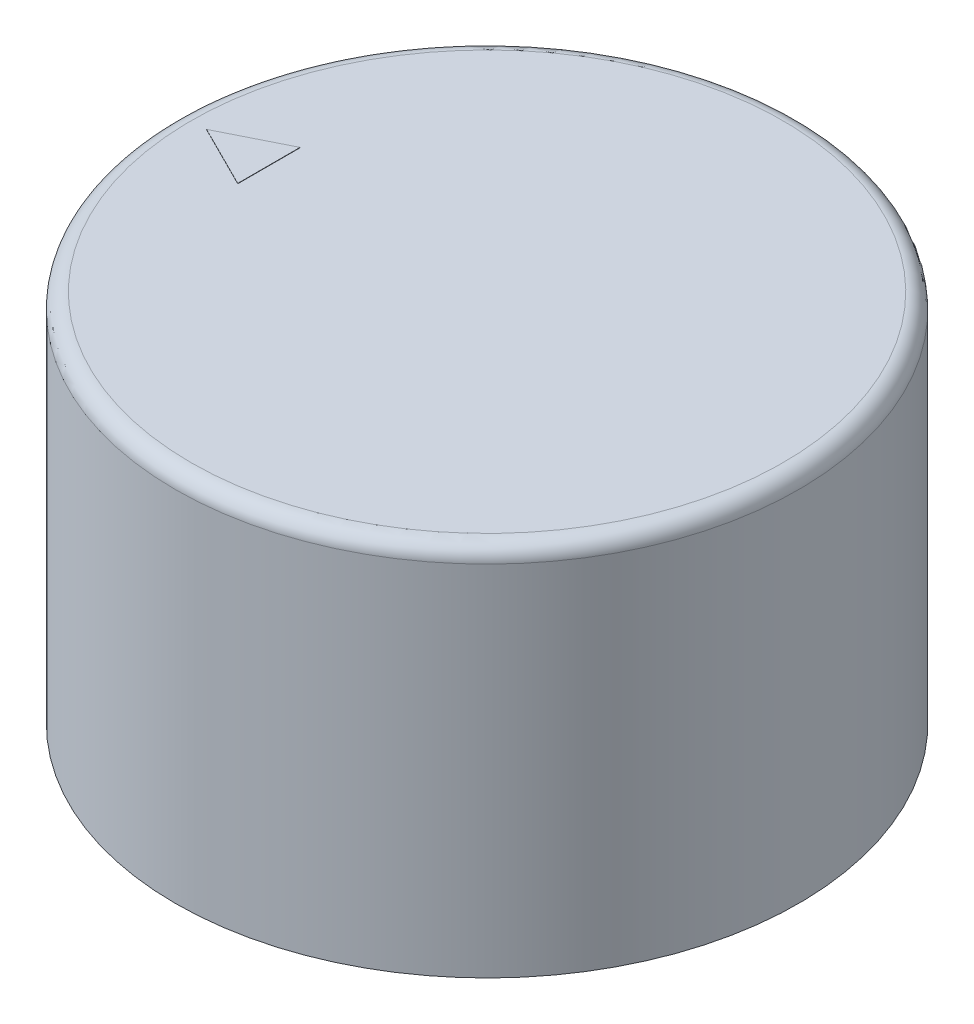
ISO-10303-21;
HEADER;
FILE_DESCRIPTION(('STEP AP214'),'2;1');
FILE_NAME('part.step','',(''),(''),'','','');
FILE_SCHEMA(('AUTOMOTIVE_DESIGN { 1 0 10303 214 1 1 1 1 }'));
ENDSEC;
DATA;
#1=APPLICATION_CONTEXT('core data for automotive mechanical design processes');
#2=APPLICATION_PROTOCOL_DEFINITION('international standard','automotive_design',2000,#1);
#3=PRODUCT_CONTEXT('',#1,'mechanical');
#4=PRODUCT('Part','Part','',(#3));
#5=PRODUCT_RELATED_PRODUCT_CATEGORY('part','',(#4));
#6=PRODUCT_DEFINITION_FORMATION('','',#4);
#7=PRODUCT_DEFINITION_CONTEXT('part definition',#1,'design');
#8=PRODUCT_DEFINITION('design','',#6,#7);
#9=PRODUCT_DEFINITION_SHAPE('','',#8);
#10=(LENGTH_UNIT() NAMED_UNIT(*) SI_UNIT(.MILLI.,.METRE.));
#11=(NAMED_UNIT(*) PLANE_ANGLE_UNIT() SI_UNIT($,.RADIAN.));
#12=(NAMED_UNIT(*) SI_UNIT($,.STERADIAN.) SOLID_ANGLE_UNIT());
#13=UNCERTAINTY_MEASURE_WITH_UNIT(LENGTH_MEASURE(1.E-05),#10,'distance_accuracy_value','');
#14=(GEOMETRIC_REPRESENTATION_CONTEXT(3) GLOBAL_UNCERTAINTY_ASSIGNED_CONTEXT((#13)) GLOBAL_UNIT_ASSIGNED_CONTEXT((#10,
#11,#12)) REPRESENTATION_CONTEXT('',''));
#15=CARTESIAN_POINT('',(0.,0.,0.));
#16=DIRECTION('',(0.,0.,1.));
#17=DIRECTION('',(1.,0.,0.));
#18=AXIS2_PLACEMENT_3D('',#15,#16,#17);
#19=CARTESIAN_POINT('',(0.,12.,0.));
#20=DIRECTION('',(0.,1.,0.));
#21=DIRECTION('',(0.,0.,1.));
#22=AXIS2_PLACEMENT_3D('',#19,#20,#21);
#23=PLANE('',#22);
#24=CARTESIAN_POINT('',(0.,12.,0.));
#25=DIRECTION('',(0.,1.,0.));
#26=DIRECTION('',(0.,0.,1.));
#27=AXIS2_PLACEMENT_3D('',#24,#25,#26);
#28=CIRCLE('',#27,9.5);
#29=CARTESIAN_POINT('',(0.,12.,9.5));
#30=VERTEX_POINT('',#29);
#31=EDGE_CURVE('E52',#30,#30,#28,.T.);
#32=ORIENTED_EDGE('',*,*,#31,.T.);
#33=EDGE_LOOP('',(#32));
#34=FACE_BOUND('',#33,.T.);
#35=DIRECTION('',(-0.894427190999916,0.,0.447213595499958));
#36=VECTOR('',#35,1.);
#37=CARTESIAN_POINT('',(-1.8,12.,-3.6));
#38=LINE('',#37,#36);
#39=CARTESIAN_POINT('',(-7.,12.,-0.999999999999999));
#40=VERTEX_POINT('',#39);
#41=CARTESIAN_POINT('',(-9.,12.,0.));
#42=VERTEX_POINT('',#41);
#43=EDGE_CURVE('E234',#40,#42,#38,.T.);
#44=ORIENTED_EDGE('',*,*,#43,.F.);
#45=DIRECTION('',(0.,0.,-1.));
#46=VECTOR('',#45,1.);
#47=CARTESIAN_POINT('',(-7.,12.,0.));
#48=LINE('',#47,#46);
#49=CARTESIAN_POINT('',(-7.,12.,1.));
#50=VERTEX_POINT('',#49);
#51=EDGE_CURVE('E94',#50,#40,#48,.T.);
#52=ORIENTED_EDGE('',*,*,#51,.F.);
#53=DIRECTION('',(0.894427190999916,0.,0.447213595499958));
#54=VECTOR('',#53,1.);
#55=CARTESIAN_POINT('',(-1.8,12.,3.6));
#56=LINE('',#55,#54);
#57=EDGE_CURVE('E77',#42,#50,#56,.T.);
#58=ORIENTED_EDGE('',*,*,#57,.F.);
#59=EDGE_LOOP('',(#44,#52,#58));
#60=FACE_BOUND('',#59,.T.);
#61=ADVANCED_FACE('F44',(#34,#60),#23,.T.);
#62=CARTESIAN_POINT('',(0.,12.,0.));
#63=DIRECTION('',(0.,-1.,0.));
#64=DIRECTION('',(0.,0.,-1.));
#65=AXIS2_PLACEMENT_3D('',#62,#63,#64);
#66=CYLINDRICAL_SURFACE('',#65,10.);
#67=CARTESIAN_POINT('',(0.,11.5,0.));
#68=DIRECTION('',(0.,1.,0.));
#69=DIRECTION('',(0.,0.,1.));
#70=AXIS2_PLACEMENT_3D('',#67,#68,#69);
#71=CIRCLE('',#70,10.);
#72=CARTESIAN_POINT('',(0.,11.5,10.));
#73=VERTEX_POINT('',#72);
#74=EDGE_CURVE('E12',#73,#73,#71,.F.);
#75=ORIENTED_EDGE('',*,*,#74,.T.);
#76=EDGE_LOOP('',(#75));
#77=FACE_BOUND('',#76,.T.);
#78=CARTESIAN_POINT('',(0.,0.,0.));
#79=DIRECTION('',(0.,1.,0.));
#80=DIRECTION('',(0.,0.,1.));
#81=AXIS2_PLACEMENT_3D('',#78,#79,#80);
#82=CIRCLE('',#81,10.);
#83=CARTESIAN_POINT('',(0.,0.,10.));
#84=VERTEX_POINT('',#83);
#85=EDGE_CURVE('E107',#84,#84,#82,.T.);
#86=ORIENTED_EDGE('',*,*,#85,.T.);
#87=EDGE_LOOP('',(#86));
#88=FACE_BOUND('',#87,.T.);
#89=ADVANCED_FACE('F125',(#77,#88),#66,.T.);
#90=CARTESIAN_POINT('',(0.,0.,0.));
#91=DIRECTION('',(0.,1.,0.));
#92=DIRECTION('',(0.,0.,1.));
#93=AXIS2_PLACEMENT_3D('',#90,#91,#92);
#94=PLANE('',#93);
#95=CARTESIAN_POINT('',(0.,0.,0.));
#96=DIRECTION('',(0.,-1.,0.));
#97=DIRECTION('',(0.,0.,-1.));
#98=AXIS2_PLACEMENT_3D('',#95,#96,#97);
#99=CIRCLE('',#98,3.);
#100=CARTESIAN_POINT('',(0.,0.,-3.));
#101=VERTEX_POINT('',#100);
#102=EDGE_CURVE('E96',#101,#101,#99,.T.);
#103=ORIENTED_EDGE('',*,*,#102,.F.);
#104=EDGE_LOOP('',(#103));
#105=FACE_BOUND('',#104,.T.);
#106=ORIENTED_EDGE('',*,*,#85,.F.);
#107=EDGE_LOOP('',(#106));
#108=FACE_BOUND('',#107,.T.);
#109=ADVANCED_FACE('F116',(#105,#108),#94,.F.);
#110=CARTESIAN_POINT('',(0.,11.5,0.));
#111=DIRECTION('',(0.,1.,0.));
#112=DIRECTION('',(0.,0.,1.));
#113=AXIS2_PLACEMENT_3D('',#110,#111,#112);
#114=TOROIDAL_SURFACE('',#113,9.5,0.5);
#115=ORIENTED_EDGE('',*,*,#74,.F.);
#116=EDGE_LOOP('',(#115));
#117=FACE_BOUND('',#116,.T.);
#118=ORIENTED_EDGE('',*,*,#31,.F.);
#119=EDGE_LOOP('',(#118));
#120=FACE_BOUND('',#119,.T.);
#121=ADVANCED_FACE('F46',(#117,#120),#114,.T.);
#122=CARTESIAN_POINT('',(0.,10.,0.));
#123=DIRECTION('',(0.,1.,0.));
#124=DIRECTION('',(0.,0.,1.));
#125=AXIS2_PLACEMENT_3D('',#122,#123,#124);
#126=PLANE('',#125);
#127=CARTESIAN_POINT('',(0.,10.,0.));
#128=DIRECTION('',(0.,1.,0.));
#129=DIRECTION('',(0.,0.,1.));
#130=AXIS2_PLACEMENT_3D('',#127,#128,#129);
#131=CIRCLE('',#130,3.);
#132=CARTESIAN_POINT('',(0.,10.,3.));
#133=VERTEX_POINT('',#132);
#134=EDGE_CURVE('E99',#133,#133,#131,.F.);
#135=ORIENTED_EDGE('',*,*,#134,.T.);
#136=EDGE_LOOP('',(#135));
#137=FACE_BOUND('',#136,.T.);
#138=ADVANCED_FACE('F115',(#137),#126,.F.);
#139=CARTESIAN_POINT('',(0.,20.4852813742386,0.));
#140=DIRECTION('',(0.,-1.,0.));
#141=DIRECTION('',(0.,0.,-1.));
#142=AXIS2_PLACEMENT_3D('',#139,#140,#141);
#143=CYLINDRICAL_SURFACE('',#142,3.);
#144=ORIENTED_EDGE('',*,*,#102,.T.);
#145=EDGE_LOOP('',(#144));
#146=FACE_BOUND('',#145,.T.);
#147=ORIENTED_EDGE('',*,*,#134,.F.);
#148=EDGE_LOOP('',(#147));
#149=FACE_BOUND('',#148,.T.);
#150=ADVANCED_FACE('F122',(#146,#149),#143,.F.);
#151=CARTESIAN_POINT('',(-7.,12.01,0.));
#152=DIRECTION('',(-1.,0.,0.));
#153=DIRECTION('',(0.,0.,1.));
#154=AXIS2_PLACEMENT_3D('',#151,#152,#153);
#155=PLANE('',#154);
#156=ORIENTED_EDGE('',*,*,#51,.T.);
#157=DIRECTION('',(0.,-1.,0.));
#158=VECTOR('',#157,1.);
#159=CARTESIAN_POINT('',(-7.,12.01,-0.999999999999999));
#160=LINE('',#159,#158);
#161=CARTESIAN_POINT('',(-7.,12.01,-0.999999999999999));
#162=VERTEX_POINT('',#161);
#163=EDGE_CURVE('E84',#162,#40,#160,.T.);
#164=ORIENTED_EDGE('',*,*,#163,.F.);
#165=DIRECTION('',(0.,0.,-1.));
#166=VECTOR('',#165,1.);
#167=CARTESIAN_POINT('',(-7.,12.01,0.));
#168=LINE('',#167,#166);
#169=CARTESIAN_POINT('',(-7.,12.01,1.));
#170=VERTEX_POINT('',#169);
#171=EDGE_CURVE('E86',#170,#162,#168,.T.);
#172=ORIENTED_EDGE('',*,*,#171,.F.);
#173=DIRECTION('',(0.,-1.,0.));
#174=VECTOR('',#173,1.);
#175=CARTESIAN_POINT('',(-7.,12.01,1.));
#176=LINE('',#175,#174);
#177=EDGE_CURVE('E101',#170,#50,#176,.T.);
#178=ORIENTED_EDGE('',*,*,#177,.T.);
#179=EDGE_LOOP('',(#156,#164,#172,#178));
#180=FACE_BOUND('',#179,.T.);
#181=ADVANCED_FACE('F92',(#180),#155,.F.);
#182=CARTESIAN_POINT('',(-1.8,12.01,-3.6));
#183=DIRECTION('',(0.447213595499958,0.,0.894427190999916));
#184=DIRECTION('',(0.894427190999916,0.,-0.447213595499958));
#185=AXIS2_PLACEMENT_3D('',#182,#183,#184);
#186=PLANE('',#185);
#187=ORIENTED_EDGE('',*,*,#43,.T.);
#188=DIRECTION('',(0.,-1.,0.));
#189=VECTOR('',#188,1.);
#190=CARTESIAN_POINT('',(-9.,12.01,0.));
#191=LINE('',#190,#189);
#192=CARTESIAN_POINT('',(-9.,12.01,0.));
#193=VERTEX_POINT('',#192);
#194=EDGE_CURVE('E59',#193,#42,#191,.T.);
#195=ORIENTED_EDGE('',*,*,#194,.F.);
#196=DIRECTION('',(-0.894427190999916,0.,0.447213595499958));
#197=VECTOR('',#196,1.);
#198=CARTESIAN_POINT('',(-1.8,12.01,-3.6));
#199=LINE('',#198,#197);
#200=EDGE_CURVE('E81',#162,#193,#199,.T.);
#201=ORIENTED_EDGE('',*,*,#200,.F.);
#202=ORIENTED_EDGE('',*,*,#163,.T.);
#203=EDGE_LOOP('',(#187,#195,#201,#202));
#204=FACE_BOUND('',#203,.T.);
#205=ADVANCED_FACE('F82',(#204),#186,.F.);
#206=CARTESIAN_POINT('',(-1.8,12.01,3.6));
#207=DIRECTION('',(0.447213595499958,0.,-0.894427190999916));
#208=DIRECTION('',(-0.894427190999916,0.,-0.447213595499958));
#209=AXIS2_PLACEMENT_3D('',#206,#207,#208);
#210=PLANE('',#209);
#211=ORIENTED_EDGE('',*,*,#57,.T.);
#212=ORIENTED_EDGE('',*,*,#177,.F.);
#213=DIRECTION('',(0.894427190999916,0.,0.447213595499958));
#214=VECTOR('',#213,1.);
#215=CARTESIAN_POINT('',(-1.8,12.01,3.6));
#216=LINE('',#215,#214);
#217=EDGE_CURVE('E67',#193,#170,#216,.T.);
#218=ORIENTED_EDGE('',*,*,#217,.F.);
#219=ORIENTED_EDGE('',*,*,#194,.T.);
#220=EDGE_LOOP('',(#211,#212,#218,#219));
#221=FACE_BOUND('',#220,.T.);
#222=ADVANCED_FACE('F143',(#221),#210,.F.);
#223=CARTESIAN_POINT('',(0.,12.01,0.));
#224=DIRECTION('',(0.,1.,0.));
#225=DIRECTION('',(0.,0.,1.));
#226=AXIS2_PLACEMENT_3D('',#223,#224,#225);
#227=PLANE('',#226);
#228=ORIENTED_EDGE('',*,*,#171,.T.);
#229=ORIENTED_EDGE('',*,*,#200,.T.);
#230=ORIENTED_EDGE('',*,*,#217,.T.);
#231=EDGE_LOOP('',(#228,#229,#230));
#232=FACE_BOUND('',#231,.T.);
#233=ADVANCED_FACE('F89',(#232),#227,.T.);
#234=CLOSED_SHELL('',(#61,#89,#109,#121,#138,#150,#181,#205,#222,#233));
#235=MANIFOLD_SOLID_BREP('B2',#234);
#236=ADVANCED_BREP_SHAPE_REPRESENTATION('',(#18,#235),#14);
#237=SHAPE_DEFINITION_REPRESENTATION(#9,#236);
ENDSEC;
END-ISO-10303-21;
